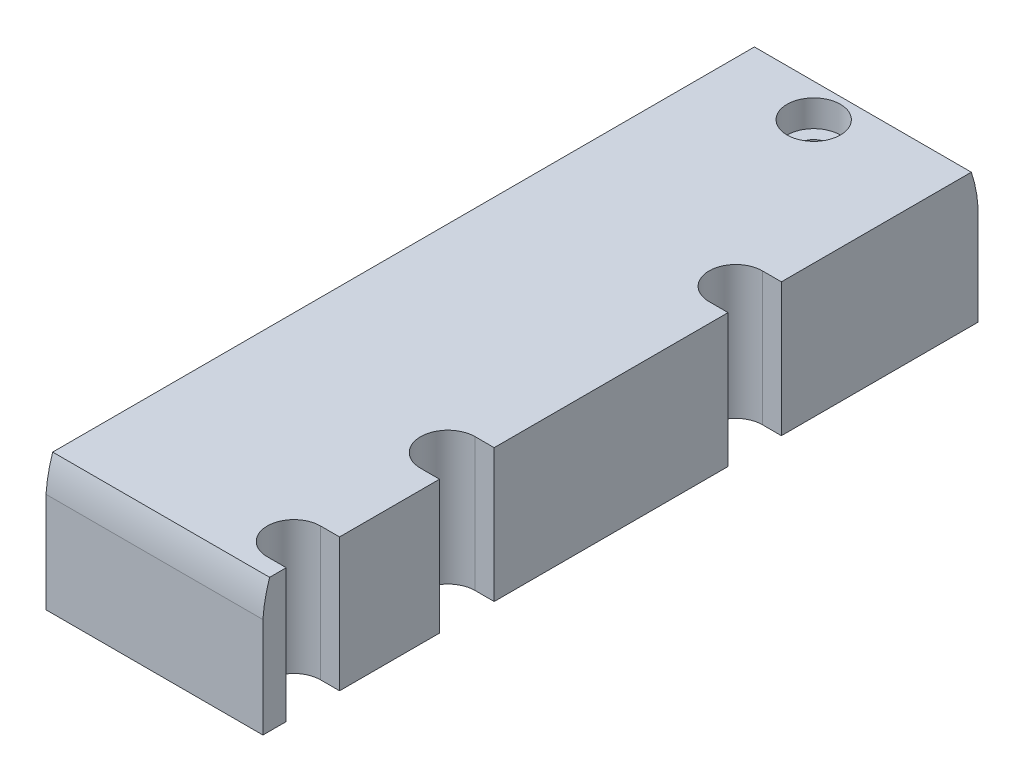
ISO-10303-21;
HEADER;
FILE_DESCRIPTION(('STEP AP214'),'2;1');
FILE_NAME('part.step','',(''),(''),'','','');
FILE_SCHEMA(('AUTOMOTIVE_DESIGN { 1 0 10303 214 1 1 1 1 }'));
ENDSEC;
DATA;
#1=APPLICATION_CONTEXT('core data for automotive mechanical design processes');
#2=APPLICATION_PROTOCOL_DEFINITION('international standard','automotive_design',2000,#1);
#3=PRODUCT_CONTEXT('',#1,'mechanical');
#4=PRODUCT('Part','Part','',(#3));
#5=PRODUCT_RELATED_PRODUCT_CATEGORY('part','',(#4));
#6=PRODUCT_DEFINITION_FORMATION('','',#4);
#7=PRODUCT_DEFINITION_CONTEXT('part definition',#1,'design');
#8=PRODUCT_DEFINITION('design','',#6,#7);
#9=PRODUCT_DEFINITION_SHAPE('','',#8);
#10=(LENGTH_UNIT() NAMED_UNIT(*) SI_UNIT(.MILLI.,.METRE.));
#11=(NAMED_UNIT(*) PLANE_ANGLE_UNIT() SI_UNIT($,.RADIAN.));
#12=(NAMED_UNIT(*) SI_UNIT($,.STERADIAN.) SOLID_ANGLE_UNIT());
#13=UNCERTAINTY_MEASURE_WITH_UNIT(LENGTH_MEASURE(1.E-05),#10,'distance_accuracy_value','');
#14=(GEOMETRIC_REPRESENTATION_CONTEXT(3) GLOBAL_UNCERTAINTY_ASSIGNED_CONTEXT((#13)) GLOBAL_UNIT_ASSIGNED_CONTEXT((#10,
#11,#12)) REPRESENTATION_CONTEXT('',''));
#15=CARTESIAN_POINT('',(0.,0.,0.));
#16=DIRECTION('',(0.,0.,1.));
#17=DIRECTION('',(1.,0.,0.));
#18=AXIS2_PLACEMENT_3D('',#15,#16,#17);
#19=CARTESIAN_POINT('',(0.,20.,0.));
#20=DIRECTION('',(0.,1.,0.));
#21=DIRECTION('',(0.,0.,1.));
#22=AXIS2_PLACEMENT_3D('',#19,#20,#21);
#23=PLANE('',#22);
#24=CARTESIAN_POINT('',(13.5,20.,-47.65));
#25=DIRECTION('',(0.,1.,0.));
#26=DIRECTION('',(0.,0.,1.));
#27=AXIS2_PLACEMENT_3D('',#24,#25,#26);
#28=CIRCLE('',#27,4.);
#29=CARTESIAN_POINT('',(13.5,20.,-43.65));
#30=VERTEX_POINT('',#29);
#31=EDGE_CURVE('E238',#30,#30,#28,.T.);
#32=ORIENTED_EDGE('',*,*,#31,.F.);
#33=EDGE_LOOP('',(#32));
#34=FACE_BOUND('',#33,.T.);
#35=CARTESIAN_POINT('',(29.3,20.,46.15));
#36=DIRECTION('',(0.,1.,0.));
#37=DIRECTION('',(0.,0.,1.));
#38=AXIS2_PLACEMENT_3D('',#35,#36,#37);
#39=CIRCLE('',#38,4.);
#40=CARTESIAN_POINT('',(29.3,20.,50.15));
#41=VERTEX_POINT('',#40);
#42=CARTESIAN_POINT('',(29.3,20.,42.15));
#43=VERTEX_POINT('',#42);
#44=EDGE_CURVE('E232',#41,#43,#39,.F.);
#45=ORIENTED_EDGE('',*,*,#44,.T.);
#46=DIRECTION('',(1.,0.,0.));
#47=VECTOR('',#46,1.);
#48=CARTESIAN_POINT('',(0.,20.,42.15));
#49=LINE('',#48,#47);
#50=CARTESIAN_POINT('',(32.15,20.,42.15));
#51=VERTEX_POINT('',#50);
#52=EDGE_CURVE('E205',#43,#51,#49,.T.);
#53=ORIENTED_EDGE('',*,*,#52,.T.);
#54=DIRECTION('',(0.,0.,-1.));
#55=VECTOR('',#54,1.);
#56=CARTESIAN_POINT('',(32.15,20.,53.65));
#57=LINE('',#56,#55);
#58=CARTESIAN_POINT('',(32.15,20.,27.15));
#59=VERTEX_POINT('',#58);
#60=EDGE_CURVE('E188',#51,#59,#57,.T.);
#61=ORIENTED_EDGE('',*,*,#60,.T.);
#62=DIRECTION('',(-1.,0.,0.));
#63=VECTOR('',#62,1.);
#64=CARTESIAN_POINT('',(0.,20.,27.15));
#65=LINE('',#64,#63);
#66=CARTESIAN_POINT('',(29.3,20.,27.15));
#67=VERTEX_POINT('',#66);
#68=EDGE_CURVE('E204',#59,#67,#65,.T.);
#69=ORIENTED_EDGE('',*,*,#68,.T.);
#70=CARTESIAN_POINT('',(29.3,20.,23.05));
#71=DIRECTION('',(0.,1.,0.));
#72=DIRECTION('',(0.,0.,1.));
#73=AXIS2_PLACEMENT_3D('',#70,#71,#72);
#74=CIRCLE('',#73,4.1);
#75=CARTESIAN_POINT('',(29.3,20.,18.95));
#76=VERTEX_POINT('',#75);
#77=EDGE_CURVE('E236',#67,#76,#74,.F.);
#78=ORIENTED_EDGE('',*,*,#77,.T.);
#79=DIRECTION('',(1.,0.,0.));
#80=VECTOR('',#79,1.);
#81=CARTESIAN_POINT('',(0.,20.,18.95));
#82=LINE('',#81,#80);
#83=CARTESIAN_POINT('',(32.15,20.,18.95));
#84=VERTEX_POINT('',#83);
#85=EDGE_CURVE('E220',#76,#84,#82,.T.);
#86=ORIENTED_EDGE('',*,*,#85,.T.);
#87=CARTESIAN_POINT('',(32.15,20.,-16.15));
#88=VERTEX_POINT('',#87);
#89=EDGE_CURVE('E183',#84,#88,#57,.T.);
#90=ORIENTED_EDGE('',*,*,#89,.T.);
#91=DIRECTION('',(-1.,0.,0.));
#92=VECTOR('',#91,1.);
#93=CARTESIAN_POINT('',(0.,20.,-16.15));
#94=LINE('',#93,#92);
#95=CARTESIAN_POINT('',(29.3,20.,-16.15));
#96=VERTEX_POINT('',#95);
#97=EDGE_CURVE('E228',#88,#96,#94,.T.);
#98=ORIENTED_EDGE('',*,*,#97,.T.);
#99=CARTESIAN_POINT('',(29.3,20.,-20.15));
#100=DIRECTION('',(0.,1.,0.));
#101=DIRECTION('',(0.,0.,1.));
#102=AXIS2_PLACEMENT_3D('',#99,#100,#101);
#103=CIRCLE('',#102,4.);
#104=CARTESIAN_POINT('',(29.3,20.,-24.15));
#105=VERTEX_POINT('',#104);
#106=EDGE_CURVE('E176',#96,#105,#103,.F.);
#107=ORIENTED_EDGE('',*,*,#106,.T.);
#108=DIRECTION('',(1.,0.,0.));
#109=VECTOR('',#108,1.);
#110=CARTESIAN_POINT('',(0.,20.,-24.15));
#111=LINE('',#110,#109);
#112=CARTESIAN_POINT('',(32.15,20.,-24.15));
#113=VERTEX_POINT('',#112);
#114=EDGE_CURVE('E159',#105,#113,#111,.T.);
#115=ORIENTED_EDGE('',*,*,#114,.T.);
#116=CARTESIAN_POINT('',(32.15,20.,-52.6483508517236));
#117=VERTEX_POINT('',#116);
#118=EDGE_CURVE('E173',#113,#117,#57,.T.);
#119=ORIENTED_EDGE('',*,*,#118,.T.);
#120=DIRECTION('',(-1.,0.,0.));
#121=VECTOR('',#120,1.);
#122=CARTESIAN_POINT('',(35.,20.,-52.6483508517236));
#123=LINE('',#122,#121);
#124=CARTESIAN_POINT('',(-0.399999999999998,20.,-52.6483508517236));
#125=VERTEX_POINT('',#124);
#126=EDGE_CURVE('E246',#117,#125,#123,.T.);
#127=ORIENTED_EDGE('',*,*,#126,.T.);
#128=DIRECTION('',(0.,0.,1.));
#129=VECTOR('',#128,1.);
#130=CARTESIAN_POINT('',(-0.4,20.,-53.65));
#131=LINE('',#130,#129);
#132=CARTESIAN_POINT('',(-0.399999999999998,20.,52.6483508517236));
#133=VERTEX_POINT('',#132);
#134=EDGE_CURVE('E184',#125,#133,#131,.T.);
#135=ORIENTED_EDGE('',*,*,#134,.T.);
#136=DIRECTION('',(-1.,0.,0.));
#137=VECTOR('',#136,1.);
#138=CARTESIAN_POINT('',(35.,20.,52.6483508517236));
#139=LINE('',#138,#137);
#140=CARTESIAN_POINT('',(32.15,20.,52.6483508517236));
#141=VERTEX_POINT('',#140);
#142=EDGE_CURVE('E253',#133,#141,#139,.F.);
#143=ORIENTED_EDGE('',*,*,#142,.T.);
#144=CARTESIAN_POINT('',(32.15,20.,50.15));
#145=VERTEX_POINT('',#144);
#146=EDGE_CURVE('E186',#141,#145,#57,.T.);
#147=ORIENTED_EDGE('',*,*,#146,.T.);
#148=DIRECTION('',(-1.,0.,0.));
#149=VECTOR('',#148,1.);
#150=CARTESIAN_POINT('',(0.,20.,50.15));
#151=LINE('',#150,#149);
#152=EDGE_CURVE('E177',#145,#41,#151,.T.);
#153=ORIENTED_EDGE('',*,*,#152,.T.);
#154=EDGE_LOOP('',(#45,#53,#61,#69,#78,#86,#90,#98,#107,#115,#119,#127,#135,#143,#147,#153));
#155=FACE_BOUND('',#154,.T.);
#156=ADVANCED_FACE('F32',(#34,#155),#23,.T.);
#157=CARTESIAN_POINT('',(32.15,20.,53.65));
#158=DIRECTION('',(-1.,0.,0.));
#159=DIRECTION('',(0.,0.,1.));
#160=AXIS2_PLACEMENT_3D('',#157,#158,#159);
#161=PLANE('',#160);
#162=DIRECTION('',(0.,-1.,0.));
#163=VECTOR('',#162,1.);
#164=CARTESIAN_POINT('',(32.15,41.,27.15));
#165=LINE('',#164,#163);
#166=CARTESIAN_POINT('',(32.15,0.,27.15));
#167=VERTEX_POINT('',#166);
#168=EDGE_CURVE('E213',#59,#167,#165,.T.);
#169=ORIENTED_EDGE('',*,*,#168,.F.);
#170=ORIENTED_EDGE('',*,*,#60,.F.);
#171=DIRECTION('',(0.,-1.,0.));
#172=VECTOR('',#171,1.);
#173=CARTESIAN_POINT('',(32.15,41.,42.15));
#174=LINE('',#173,#172);
#175=CARTESIAN_POINT('',(32.15,0.,42.15));
#176=VERTEX_POINT('',#175);
#177=EDGE_CURVE('E211',#51,#176,#174,.T.);
#178=ORIENTED_EDGE('',*,*,#177,.T.);
#179=DIRECTION('',(0.,0.,-1.));
#180=VECTOR('',#179,1.);
#181=CARTESIAN_POINT('',(32.15,0.,53.65));
#182=LINE('',#181,#180);
#183=EDGE_CURVE('E214',#176,#167,#182,.T.);
#184=ORIENTED_EDGE('',*,*,#183,.T.);
#185=EDGE_LOOP('',(#169,#170,#178,#184));
#186=FACE_BOUND('',#185,.T.);
#187=ADVANCED_FACE('F209',(#186),#161,.F.);
#188=DIRECTION('',(0.,-1.,0.));
#189=VECTOR('',#188,1.);
#190=CARTESIAN_POINT('',(32.15,41.,50.15));
#191=LINE('',#190,#189);
#192=CARTESIAN_POINT('',(32.15,0.,50.15));
#193=VERTEX_POINT('',#192);
#194=EDGE_CURVE('E166',#145,#193,#191,.T.);
#195=ORIENTED_EDGE('',*,*,#194,.F.);
#196=ORIENTED_EDGE('',*,*,#146,.F.);
#197=CARTESIAN_POINT('',(32.15,13.6000000000017,33.7000000000016));
#198=DIRECTION('',(-1.,0.,0.));
#199=DIRECTION('',(0.,0.,1.));
#200=AXIS2_PLACEMENT_3D('',#197,#198,#199);
#201=CIRCLE('',#200,19.9999999999983);
#202=CARTESIAN_POINT('',(32.15,15.01332940251,53.65));
#203=VERTEX_POINT('',#202);
#204=EDGE_CURVE('E282',#203,#141,#201,.T.);
#205=ORIENTED_EDGE('',*,*,#204,.F.);
#206=DIRECTION('',(0.,-1.,0.));
#207=VECTOR('',#206,1.);
#208=CARTESIAN_POINT('',(32.15,20.,53.65));
#209=LINE('',#208,#207);
#210=CARTESIAN_POINT('',(32.15,0.,53.65));
#211=VERTEX_POINT('',#210);
#212=EDGE_CURVE('E278',#203,#211,#209,.T.);
#213=ORIENTED_EDGE('',*,*,#212,.T.);
#214=EDGE_CURVE('E271',#211,#193,#182,.T.);
#215=ORIENTED_EDGE('',*,*,#214,.T.);
#216=EDGE_LOOP('',(#195,#196,#205,#213,#215));
#217=FACE_BOUND('',#216,.T.);
#218=ADVANCED_FACE('F339',(#217),#161,.F.);
#219=DIRECTION('',(0.,-1.,0.));
#220=VECTOR('',#219,1.);
#221=CARTESIAN_POINT('',(32.15,41.,-24.15));
#222=LINE('',#221,#220);
#223=CARTESIAN_POINT('',(32.15,0.,-24.15));
#224=VERTEX_POINT('',#223);
#225=EDGE_CURVE('E155',#113,#224,#222,.T.);
#226=ORIENTED_EDGE('',*,*,#225,.T.);
#227=CARTESIAN_POINT('',(32.15,0.,-53.65));
#228=VERTEX_POINT('',#227);
#229=EDGE_CURVE('E268',#224,#228,#182,.T.);
#230=ORIENTED_EDGE('',*,*,#229,.T.);
#231=DIRECTION('',(0.,-1.,0.));
#232=VECTOR('',#231,1.);
#233=CARTESIAN_POINT('',(32.15,20.,-53.65));
#234=LINE('',#233,#232);
#235=CARTESIAN_POINT('',(32.15,15.01332940251,-53.65));
#236=VERTEX_POINT('',#235);
#237=EDGE_CURVE('E197',#236,#228,#234,.T.);
#238=ORIENTED_EDGE('',*,*,#237,.F.);
#239=CARTESIAN_POINT('',(32.15,13.6000000000017,-33.7000000000016));
#240=DIRECTION('',(-1.,0.,0.));
#241=DIRECTION('',(0.,0.,1.));
#242=AXIS2_PLACEMENT_3D('',#239,#240,#241);
#243=CIRCLE('',#242,19.9999999999983);
#244=EDGE_CURVE('E182',#117,#236,#243,.T.);
#245=ORIENTED_EDGE('',*,*,#244,.F.);
#246=ORIENTED_EDGE('',*,*,#118,.F.);
#247=EDGE_LOOP('',(#226,#230,#238,#245,#246));
#248=FACE_BOUND('',#247,.T.);
#249=ADVANCED_FACE('F180',(#248),#161,.F.);
#250=DIRECTION('',(0.,-1.,0.));
#251=VECTOR('',#250,1.);
#252=CARTESIAN_POINT('',(32.15,41.,-16.15));
#253=LINE('',#252,#251);
#254=CARTESIAN_POINT('',(32.15,0.,-16.15));
#255=VERTEX_POINT('',#254);
#256=EDGE_CURVE('E55',#88,#255,#253,.T.);
#257=ORIENTED_EDGE('',*,*,#256,.F.);
#258=ORIENTED_EDGE('',*,*,#89,.F.);
#259=DIRECTION('',(0.,-1.,0.));
#260=VECTOR('',#259,1.);
#261=CARTESIAN_POINT('',(32.15,41.,18.95));
#262=LINE('',#261,#260);
#263=CARTESIAN_POINT('',(32.15,0.,18.95));
#264=VERTEX_POINT('',#263);
#265=EDGE_CURVE('E349',#84,#264,#262,.T.);
#266=ORIENTED_EDGE('',*,*,#265,.T.);
#267=EDGE_CURVE('E315',#264,#255,#182,.T.);
#268=ORIENTED_EDGE('',*,*,#267,.T.);
#269=EDGE_LOOP('',(#257,#258,#266,#268));
#270=FACE_BOUND('',#269,.T.);
#271=ADVANCED_FACE('F352',(#270),#161,.F.);
#272=CARTESIAN_POINT('',(0.,0.,0.));
#273=DIRECTION('',(0.,1.,0.));
#274=DIRECTION('',(0.,0.,1.));
#275=AXIS2_PLACEMENT_3D('',#272,#273,#274);
#276=PLANE('',#275);
#277=CARTESIAN_POINT('',(13.5,0.,-47.65));
#278=DIRECTION('',(0.,1.,0.));
#279=DIRECTION('',(0.,0.,1.));
#280=AXIS2_PLACEMENT_3D('',#277,#278,#279);
#281=CIRCLE('',#280,2.);
#282=CARTESIAN_POINT('',(13.5,0.,-45.65));
#283=VERTEX_POINT('',#282);
#284=EDGE_CURVE('E257',#283,#283,#281,.T.);
#285=ORIENTED_EDGE('',*,*,#284,.T.);
#286=EDGE_LOOP('',(#285));
#287=FACE_BOUND('',#286,.T.);
#288=DIRECTION('',(1.,0.,0.));
#289=VECTOR('',#288,1.);
#290=CARTESIAN_POINT('',(0.,0.,42.15));
#291=LINE('',#290,#289);
#292=CARTESIAN_POINT('',(29.3,0.,42.15));
#293=VERTEX_POINT('',#292);
#294=EDGE_CURVE('E11',#293,#176,#291,.T.);
#295=ORIENTED_EDGE('',*,*,#294,.F.);
#296=CARTESIAN_POINT('',(29.3,0.,46.15));
#297=DIRECTION('',(0.,1.,0.));
#298=DIRECTION('',(0.,0.,1.));
#299=AXIS2_PLACEMENT_3D('',#296,#297,#298);
#300=CIRCLE('',#299,4.);
#301=CARTESIAN_POINT('',(29.3,0.,50.15));
#302=VERTEX_POINT('',#301);
#303=EDGE_CURVE('E40',#302,#293,#300,.F.);
#304=ORIENTED_EDGE('',*,*,#303,.F.);
#305=DIRECTION('',(-1.,0.,0.));
#306=VECTOR('',#305,1.);
#307=CARTESIAN_POINT('',(0.,0.,50.15));
#308=LINE('',#307,#306);
#309=EDGE_CURVE('E299',#193,#302,#308,.T.);
#310=ORIENTED_EDGE('',*,*,#309,.F.);
#311=ORIENTED_EDGE('',*,*,#214,.F.);
#312=DIRECTION('',(1.,0.,0.));
#313=VECTOR('',#312,1.);
#314=CARTESIAN_POINT('',(-0.4,0.,53.65));
#315=LINE('',#314,#313);
#316=CARTESIAN_POINT('',(-0.4,0.,53.65));
#317=VERTEX_POINT('',#316);
#318=EDGE_CURVE('E263',#317,#211,#315,.T.);
#319=ORIENTED_EDGE('',*,*,#318,.F.);
#320=DIRECTION('',(0.,0.,1.));
#321=VECTOR('',#320,1.);
#322=CARTESIAN_POINT('',(-0.4,0.,-53.65));
#323=LINE('',#322,#321);
#324=CARTESIAN_POINT('',(-0.4,0.,-53.65));
#325=VERTEX_POINT('',#324);
#326=EDGE_CURVE('E259',#325,#317,#323,.T.);
#327=ORIENTED_EDGE('',*,*,#326,.F.);
#328=DIRECTION('',(-1.,0.,0.));
#329=VECTOR('',#328,1.);
#330=CARTESIAN_POINT('',(32.15,0.,-53.65));
#331=LINE('',#330,#329);
#332=EDGE_CURVE('E189',#228,#325,#331,.T.);
#333=ORIENTED_EDGE('',*,*,#332,.F.);
#334=ORIENTED_EDGE('',*,*,#229,.F.);
#335=DIRECTION('',(1.,0.,0.));
#336=VECTOR('',#335,1.);
#337=CARTESIAN_POINT('',(0.,0.,-24.15));
#338=LINE('',#337,#336);
#339=CARTESIAN_POINT('',(29.3,0.,-24.15));
#340=VERTEX_POINT('',#339);
#341=EDGE_CURVE('E162',#340,#224,#338,.T.);
#342=ORIENTED_EDGE('',*,*,#341,.F.);
#343=CARTESIAN_POINT('',(29.3,0.,-20.15));
#344=DIRECTION('',(0.,1.,0.));
#345=DIRECTION('',(0.,0.,1.));
#346=AXIS2_PLACEMENT_3D('',#343,#344,#345);
#347=CIRCLE('',#346,4.);
#348=CARTESIAN_POINT('',(29.3,0.,-16.15));
#349=VERTEX_POINT('',#348);
#350=EDGE_CURVE('E296',#349,#340,#347,.F.);
#351=ORIENTED_EDGE('',*,*,#350,.F.);
#352=DIRECTION('',(-1.,0.,0.));
#353=VECTOR('',#352,1.);
#354=CARTESIAN_POINT('',(0.,0.,-16.15));
#355=LINE('',#354,#353);
#356=EDGE_CURVE('E294',#255,#349,#355,.T.);
#357=ORIENTED_EDGE('',*,*,#356,.F.);
#358=ORIENTED_EDGE('',*,*,#267,.F.);
#359=DIRECTION('',(1.,0.,0.));
#360=VECTOR('',#359,1.);
#361=CARTESIAN_POINT('',(0.,0.,18.95));
#362=LINE('',#361,#360);
#363=CARTESIAN_POINT('',(29.3,0.,18.95));
#364=VERTEX_POINT('',#363);
#365=EDGE_CURVE('E286',#364,#264,#362,.T.);
#366=ORIENTED_EDGE('',*,*,#365,.F.);
#367=CARTESIAN_POINT('',(29.3,0.,23.05));
#368=DIRECTION('',(0.,1.,0.));
#369=DIRECTION('',(0.,0.,1.));
#370=AXIS2_PLACEMENT_3D('',#367,#368,#369);
#371=CIRCLE('',#370,4.1);
#372=CARTESIAN_POINT('',(29.3,0.,27.15));
#373=VERTEX_POINT('',#372);
#374=EDGE_CURVE('E290',#373,#364,#371,.F.);
#375=ORIENTED_EDGE('',*,*,#374,.F.);
#376=DIRECTION('',(-1.,0.,0.));
#377=VECTOR('',#376,1.);
#378=CARTESIAN_POINT('',(0.,0.,27.15));
#379=LINE('',#378,#377);
#380=EDGE_CURVE('E292',#167,#373,#379,.T.);
#381=ORIENTED_EDGE('',*,*,#380,.F.);
#382=ORIENTED_EDGE('',*,*,#183,.F.);
#383=EDGE_LOOP('',(#295,#304,#310,#311,#319,#327,#333,#334,#342,#351,#357,#358,#366,#375,#381,#382));
#384=FACE_BOUND('',#383,.T.);
#385=ADVANCED_FACE('F313',(#287,#384),#276,.F.);
#386=CARTESIAN_POINT('',(13.5,20.,-47.65));
#387=DIRECTION('',(0.,-1.,0.));
#388=DIRECTION('',(0.,0.,-1.));
#389=AXIS2_PLACEMENT_3D('',#386,#387,#388);
#390=CYLINDRICAL_SURFACE('',#389,2.);
#391=ORIENTED_EDGE('',*,*,#284,.F.);
#392=EDGE_LOOP('',(#391));
#393=FACE_BOUND('',#392,.T.);
#394=CARTESIAN_POINT('',(13.5,16.,-47.65));
#395=DIRECTION('',(0.,1.,0.));
#396=DIRECTION('',(0.,0.,1.));
#397=AXIS2_PLACEMENT_3D('',#394,#395,#396);
#398=CIRCLE('',#397,2.);
#399=CARTESIAN_POINT('',(13.5,16.,-45.65));
#400=VERTEX_POINT('',#399);
#401=EDGE_CURVE('E242',#400,#400,#398,.T.);
#402=ORIENTED_EDGE('',*,*,#401,.T.);
#403=EDGE_LOOP('',(#402));
#404=FACE_BOUND('',#403,.T.);
#405=ADVANCED_FACE('F378',(#393,#404),#390,.F.);
#406=CARTESIAN_POINT('',(-0.4,20.,-53.65));
#407=DIRECTION('',(1.,0.,0.));
#408=DIRECTION('',(0.,0.,-1.));
#409=AXIS2_PLACEMENT_3D('',#406,#407,#408);
#410=PLANE('',#409);
#411=CARTESIAN_POINT('',(-0.399999999999998,13.6000000000017,-33.7000000000016));
#412=DIRECTION('',(1.,0.,0.));
#413=DIRECTION('',(0.,0.,-1.));
#414=AXIS2_PLACEMENT_3D('',#411,#412,#413);
#415=CIRCLE('',#414,19.9999999999983);
#416=CARTESIAN_POINT('',(-0.399999999999998,15.01332940251,-53.65));
#417=VERTEX_POINT('',#416);
#418=EDGE_CURVE('E248',#417,#125,#415,.T.);
#419=ORIENTED_EDGE('',*,*,#418,.F.);
#420=DIRECTION('',(0.,-1.,0.));
#421=VECTOR('',#420,1.);
#422=CARTESIAN_POINT('',(-0.4,20.,-53.65));
#423=LINE('',#422,#421);
#424=EDGE_CURVE('E193',#417,#325,#423,.T.);
#425=ORIENTED_EDGE('',*,*,#424,.T.);
#426=ORIENTED_EDGE('',*,*,#326,.T.);
#427=DIRECTION('',(0.,-1.,0.));
#428=VECTOR('',#427,1.);
#429=CARTESIAN_POINT('',(-0.4,20.,53.65));
#430=LINE('',#429,#428);
#431=CARTESIAN_POINT('',(-0.399999999999998,15.01332940251,53.65));
#432=VERTEX_POINT('',#431);
#433=EDGE_CURVE('E280',#432,#317,#430,.T.);
#434=ORIENTED_EDGE('',*,*,#433,.F.);
#435=CARTESIAN_POINT('',(-0.399999999999998,13.6000000000017,33.7000000000016));
#436=DIRECTION('',(1.,0.,0.));
#437=DIRECTION('',(0.,0.,-1.));
#438=AXIS2_PLACEMENT_3D('',#435,#436,#437);
#439=CIRCLE('',#438,19.9999999999983);
#440=EDGE_CURVE('E255',#133,#432,#439,.T.);
#441=ORIENTED_EDGE('',*,*,#440,.F.);
#442=ORIENTED_EDGE('',*,*,#134,.F.);
#443=EDGE_LOOP('',(#419,#425,#426,#434,#441,#442));
#444=FACE_BOUND('',#443,.T.);
#445=ADVANCED_FACE('F34',(#444),#410,.F.);
#446=CARTESIAN_POINT('',(32.15,20.,-53.65));
#447=DIRECTION('',(0.,0.,1.));
#448=DIRECTION('',(1.,0.,0.));
#449=AXIS2_PLACEMENT_3D('',#446,#447,#448);
#450=PLANE('',#449);
#451=DIRECTION('',(-1.,0.,0.));
#452=VECTOR('',#451,1.);
#453=CARTESIAN_POINT('',(35.,15.01332940251,-53.65));
#454=LINE('',#453,#452);
#455=EDGE_CURVE('E284',#236,#417,#454,.T.);
#456=ORIENTED_EDGE('',*,*,#455,.F.);
#457=ORIENTED_EDGE('',*,*,#237,.T.);
#458=ORIENTED_EDGE('',*,*,#332,.T.);
#459=ORIENTED_EDGE('',*,*,#424,.F.);
#460=EDGE_LOOP('',(#456,#457,#458,#459));
#461=FACE_BOUND('',#460,.T.);
#462=ADVANCED_FACE('F323',(#461),#450,.F.);
#463=CARTESIAN_POINT('',(-0.4,20.,53.65));
#464=DIRECTION('',(0.,0.,-1.));
#465=DIRECTION('',(-1.,0.,0.));
#466=AXIS2_PLACEMENT_3D('',#463,#464,#465);
#467=PLANE('',#466);
#468=DIRECTION('',(-1.,0.,0.));
#469=VECTOR('',#468,1.);
#470=CARTESIAN_POINT('',(35.,15.01332940251,53.65));
#471=LINE('',#470,#469);
#472=EDGE_CURVE('E250',#203,#432,#471,.T.);
#473=ORIENTED_EDGE('',*,*,#472,.T.);
#474=ORIENTED_EDGE('',*,*,#433,.T.);
#475=ORIENTED_EDGE('',*,*,#318,.T.);
#476=ORIENTED_EDGE('',*,*,#212,.F.);
#477=EDGE_LOOP('',(#473,#474,#475,#476));
#478=FACE_BOUND('',#477,.T.);
#479=ADVANCED_FACE('F329',(#478),#467,.F.);
#480=CARTESIAN_POINT('',(35.,13.6000000000017,33.7000000000016));
#481=DIRECTION('',(-1.,0.,0.));
#482=DIRECTION('',(0.,0.,1.));
#483=AXIS2_PLACEMENT_3D('',#480,#481,#482);
#484=CYLINDRICAL_SURFACE('',#483,19.9999999999983);
#485=ORIENTED_EDGE('',*,*,#440,.T.);
#486=ORIENTED_EDGE('',*,*,#472,.F.);
#487=ORIENTED_EDGE('',*,*,#204,.T.);
#488=ORIENTED_EDGE('',*,*,#142,.F.);
#489=EDGE_LOOP('',(#485,#486,#487,#488));
#490=FACE_BOUND('',#489,.T.);
#491=ADVANCED_FACE('F335',(#490),#484,.T.);
#492=CARTESIAN_POINT('',(35.,13.6000000000017,-33.7000000000016));
#493=DIRECTION('',(-1.,0.,0.));
#494=DIRECTION('',(0.,0.,1.));
#495=AXIS2_PLACEMENT_3D('',#492,#493,#494);
#496=CYLINDRICAL_SURFACE('',#495,19.9999999999983);
#497=ORIENTED_EDGE('',*,*,#418,.T.);
#498=ORIENTED_EDGE('',*,*,#126,.F.);
#499=ORIENTED_EDGE('',*,*,#244,.T.);
#500=ORIENTED_EDGE('',*,*,#455,.T.);
#501=EDGE_LOOP('',(#497,#498,#499,#500));
#502=FACE_BOUND('',#501,.T.);
#503=ADVANCED_FACE('F387',(#502),#496,.T.);
#504=CARTESIAN_POINT('',(13.5,16.,-47.65));
#505=DIRECTION('',(0.,1.,0.));
#506=DIRECTION('',(0.,0.,1.));
#507=AXIS2_PLACEMENT_3D('',#504,#505,#506);
#508=CYLINDRICAL_SURFACE('',#507,4.);
#509=CARTESIAN_POINT('',(13.5,16.,-47.65));
#510=DIRECTION('',(0.,1.,0.));
#511=DIRECTION('',(0.,0.,1.));
#512=AXIS2_PLACEMENT_3D('',#509,#510,#511);
#513=CIRCLE('',#512,4.);
#514=CARTESIAN_POINT('',(13.5,16.,-43.65));
#515=VERTEX_POINT('',#514);
#516=EDGE_CURVE('E239',#515,#515,#513,.T.);
#517=ORIENTED_EDGE('',*,*,#516,.F.);
#518=EDGE_LOOP('',(#517));
#519=FACE_BOUND('',#518,.T.);
#520=ORIENTED_EDGE('',*,*,#31,.T.);
#521=EDGE_LOOP('',(#520));
#522=FACE_BOUND('',#521,.T.);
#523=ADVANCED_FACE('F391',(#519,#522),#508,.F.);
#524=CARTESIAN_POINT('',(13.5,16.,-47.65));
#525=DIRECTION('',(0.,1.,0.));
#526=DIRECTION('',(0.,0.,1.));
#527=AXIS2_PLACEMENT_3D('',#524,#525,#526);
#528=PLANE('',#527);
#529=ORIENTED_EDGE('',*,*,#401,.F.);
#530=EDGE_LOOP('',(#529));
#531=FACE_BOUND('',#530,.T.);
#532=ORIENTED_EDGE('',*,*,#516,.T.);
#533=EDGE_LOOP('',(#532));
#534=FACE_BOUND('',#533,.T.);
#535=ADVANCED_FACE('F397',(#531,#534),#528,.T.);
#536=CARTESIAN_POINT('',(32.15,41.,18.95));
#537=DIRECTION('',(0.,0.,1.));
#538=DIRECTION('',(1.,0.,0.));
#539=AXIS2_PLACEMENT_3D('',#536,#537,#538);
#540=PLANE('',#539);
#541=DIRECTION('',(0.,-1.,0.));
#542=VECTOR('',#541,1.);
#543=CARTESIAN_POINT('',(29.3,41.,18.95));
#544=LINE('',#543,#542);
#545=EDGE_CURVE('E47',#76,#364,#544,.T.);
#546=ORIENTED_EDGE('',*,*,#545,.T.);
#547=ORIENTED_EDGE('',*,*,#365,.T.);
#548=ORIENTED_EDGE('',*,*,#265,.F.);
#549=ORIENTED_EDGE('',*,*,#85,.F.);
#550=EDGE_LOOP('',(#546,#547,#548,#549));
#551=FACE_BOUND('',#550,.T.);
#552=ADVANCED_FACE('F401',(#551),#540,.T.);
#553=CARTESIAN_POINT('',(29.3,41.,27.15));
#554=DIRECTION('',(0.,0.,-1.));
#555=DIRECTION('',(-1.,0.,0.));
#556=AXIS2_PLACEMENT_3D('',#553,#554,#555);
#557=PLANE('',#556);
#558=ORIENTED_EDGE('',*,*,#168,.T.);
#559=ORIENTED_EDGE('',*,*,#380,.T.);
#560=DIRECTION('',(0.,-1.,0.));
#561=VECTOR('',#560,1.);
#562=CARTESIAN_POINT('',(29.3,41.,27.15));
#563=LINE('',#562,#561);
#564=EDGE_CURVE('E217',#67,#373,#563,.T.);
#565=ORIENTED_EDGE('',*,*,#564,.F.);
#566=ORIENTED_EDGE('',*,*,#68,.F.);
#567=EDGE_LOOP('',(#558,#559,#565,#566));
#568=FACE_BOUND('',#567,.T.);
#569=ADVANCED_FACE('F405',(#568),#557,.T.);
#570=CARTESIAN_POINT('',(29.3,41.,23.05));
#571=DIRECTION('',(0.,-1.,0.));
#572=DIRECTION('',(0.,0.,-1.));
#573=AXIS2_PLACEMENT_3D('',#570,#571,#572);
#574=CYLINDRICAL_SURFACE('',#573,4.1);
#575=ORIENTED_EDGE('',*,*,#564,.T.);
#576=ORIENTED_EDGE('',*,*,#374,.T.);
#577=ORIENTED_EDGE('',*,*,#545,.F.);
#578=ORIENTED_EDGE('',*,*,#77,.F.);
#579=EDGE_LOOP('',(#575,#576,#577,#578));
#580=FACE_BOUND('',#579,.T.);
#581=ADVANCED_FACE('F366',(#580),#574,.F.);
#582=CARTESIAN_POINT('',(29.3,41.,-16.15));
#583=DIRECTION('',(0.,0.,-1.));
#584=DIRECTION('',(-1.,0.,0.));
#585=AXIS2_PLACEMENT_3D('',#582,#583,#584);
#586=PLANE('',#585);
#587=ORIENTED_EDGE('',*,*,#256,.T.);
#588=ORIENTED_EDGE('',*,*,#356,.T.);
#589=DIRECTION('',(0.,-1.,0.));
#590=VECTOR('',#589,1.);
#591=CARTESIAN_POINT('',(29.3,41.,-16.15));
#592=LINE('',#591,#590);
#593=EDGE_CURVE('E345',#96,#349,#592,.T.);
#594=ORIENTED_EDGE('',*,*,#593,.F.);
#595=ORIENTED_EDGE('',*,*,#97,.F.);
#596=EDGE_LOOP('',(#587,#588,#594,#595));
#597=FACE_BOUND('',#596,.T.);
#598=ADVANCED_FACE('F356',(#597),#586,.T.);
#599=CARTESIAN_POINT('',(29.3,41.,-20.15));
#600=DIRECTION('',(0.,-1.,0.));
#601=DIRECTION('',(0.,0.,-1.));
#602=AXIS2_PLACEMENT_3D('',#599,#600,#601);
#603=CYLINDRICAL_SURFACE('',#602,4.);
#604=ORIENTED_EDGE('',*,*,#593,.T.);
#605=ORIENTED_EDGE('',*,*,#350,.T.);
#606=DIRECTION('',(0.,-1.,0.));
#607=VECTOR('',#606,1.);
#608=CARTESIAN_POINT('',(29.3,41.,-24.15));
#609=LINE('',#608,#607);
#610=EDGE_CURVE('E167',#105,#340,#609,.T.);
#611=ORIENTED_EDGE('',*,*,#610,.F.);
#612=ORIENTED_EDGE('',*,*,#106,.F.);
#613=EDGE_LOOP('',(#604,#605,#611,#612));
#614=FACE_BOUND('',#613,.T.);
#615=ADVANCED_FACE('F358',(#614),#603,.F.);
#616=CARTESIAN_POINT('',(32.15,41.,-24.15));
#617=DIRECTION('',(0.,0.,1.));
#618=DIRECTION('',(1.,0.,0.));
#619=AXIS2_PLACEMENT_3D('',#616,#617,#618);
#620=PLANE('',#619);
#621=ORIENTED_EDGE('',*,*,#610,.T.);
#622=ORIENTED_EDGE('',*,*,#341,.T.);
#623=ORIENTED_EDGE('',*,*,#225,.F.);
#624=ORIENTED_EDGE('',*,*,#114,.F.);
#625=EDGE_LOOP('',(#621,#622,#623,#624));
#626=FACE_BOUND('',#625,.T.);
#627=ADVANCED_FACE('F158',(#626),#620,.T.);
#628=CARTESIAN_POINT('',(32.15,41.,42.15));
#629=DIRECTION('',(0.,0.,1.));
#630=DIRECTION('',(1.,0.,0.));
#631=AXIS2_PLACEMENT_3D('',#628,#629,#630);
#632=PLANE('',#631);
#633=DIRECTION('',(0.,-1.,0.));
#634=VECTOR('',#633,1.);
#635=CARTESIAN_POINT('',(29.3,41.,42.15));
#636=LINE('',#635,#634);
#637=EDGE_CURVE('E222',#43,#293,#636,.T.);
#638=ORIENTED_EDGE('',*,*,#637,.T.);
#639=ORIENTED_EDGE('',*,*,#294,.T.);
#640=ORIENTED_EDGE('',*,*,#177,.F.);
#641=ORIENTED_EDGE('',*,*,#52,.F.);
#642=EDGE_LOOP('',(#638,#639,#640,#641));
#643=FACE_BOUND('',#642,.T.);
#644=ADVANCED_FACE('F312',(#643),#632,.T.);
#645=CARTESIAN_POINT('',(29.3,41.,46.15));
#646=DIRECTION('',(0.,-1.,0.));
#647=DIRECTION('',(0.,0.,-1.));
#648=AXIS2_PLACEMENT_3D('',#645,#646,#647);
#649=CYLINDRICAL_SURFACE('',#648,4.);
#650=DIRECTION('',(0.,-1.,0.));
#651=VECTOR('',#650,1.);
#652=CARTESIAN_POINT('',(29.3,41.,50.15));
#653=LINE('',#652,#651);
#654=EDGE_CURVE('E307',#41,#302,#653,.T.);
#655=ORIENTED_EDGE('',*,*,#654,.T.);
#656=ORIENTED_EDGE('',*,*,#303,.T.);
#657=ORIENTED_EDGE('',*,*,#637,.F.);
#658=ORIENTED_EDGE('',*,*,#44,.F.);
#659=EDGE_LOOP('',(#655,#656,#657,#658));
#660=FACE_BOUND('',#659,.T.);
#661=ADVANCED_FACE('F305',(#660),#649,.F.);
#662=CARTESIAN_POINT('',(29.3,41.,50.15));
#663=DIRECTION('',(0.,0.,-1.));
#664=DIRECTION('',(-1.,0.,0.));
#665=AXIS2_PLACEMENT_3D('',#662,#663,#664);
#666=PLANE('',#665);
#667=ORIENTED_EDGE('',*,*,#194,.T.);
#668=ORIENTED_EDGE('',*,*,#309,.T.);
#669=ORIENTED_EDGE('',*,*,#654,.F.);
#670=ORIENTED_EDGE('',*,*,#152,.F.);
#671=EDGE_LOOP('',(#667,#668,#669,#670));
#672=FACE_BOUND('',#671,.T.);
#673=ADVANCED_FACE('F413',(#672),#666,.T.);
#674=CLOSED_SHELL('',(#156,#187,#218,#249,#271,#385,#405,#445,#462,#479,#491,#503,#523,#535,
#552,#569,#581,#598,#615,#627,#644,#661,#673));
#675=MANIFOLD_SOLID_BREP('B2',#674);
#676=ADVANCED_BREP_SHAPE_REPRESENTATION('',(#18,#675),#14);
#677=SHAPE_DEFINITION_REPRESENTATION(#9,#676);
ENDSEC;
END-ISO-10303-21;
